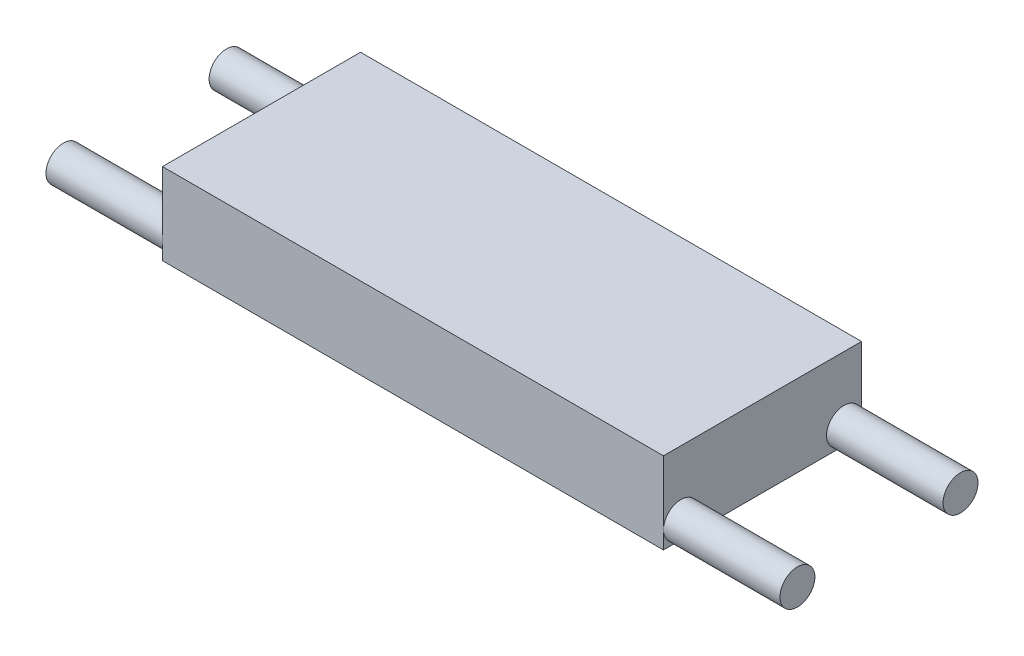
ISO-10303-21;
HEADER;
FILE_DESCRIPTION(('STEP AP214'),'2;1');
FILE_NAME('part.step','',(''),(''),'','','');
FILE_SCHEMA(('AUTOMOTIVE_DESIGN { 1 0 10303 214 1 1 1 1 }'));
ENDSEC;
DATA;
#1=APPLICATION_CONTEXT('core data for automotive mechanical design processes');
#2=APPLICATION_PROTOCOL_DEFINITION('international standard','automotive_design',2000,#1);
#3=PRODUCT_CONTEXT('',#1,'mechanical');
#4=PRODUCT('Part','Part','',(#3));
#5=PRODUCT_RELATED_PRODUCT_CATEGORY('part','',(#4));
#6=PRODUCT_DEFINITION_FORMATION('','',#4);
#7=PRODUCT_DEFINITION_CONTEXT('part definition',#1,'design');
#8=PRODUCT_DEFINITION('design','',#6,#7);
#9=PRODUCT_DEFINITION_SHAPE('','',#8);
#10=(LENGTH_UNIT() NAMED_UNIT(*) SI_UNIT(.MILLI.,.METRE.));
#11=(NAMED_UNIT(*) PLANE_ANGLE_UNIT() SI_UNIT($,.RADIAN.));
#12=(NAMED_UNIT(*) SI_UNIT($,.STERADIAN.) SOLID_ANGLE_UNIT());
#13=UNCERTAINTY_MEASURE_WITH_UNIT(LENGTH_MEASURE(1.E-05),#10,'distance_accuracy_value','');
#14=(GEOMETRIC_REPRESENTATION_CONTEXT(3) GLOBAL_UNCERTAINTY_ASSIGNED_CONTEXT((#13)) GLOBAL_UNIT_ASSIGNED_CONTEXT((#10,
#11,#12)) REPRESENTATION_CONTEXT('',''));
#15=CARTESIAN_POINT('',(0.,0.,0.));
#16=DIRECTION('',(0.,0.,1.));
#17=DIRECTION('',(1.,0.,0.));
#18=AXIS2_PLACEMENT_3D('',#15,#16,#17);
#19=CARTESIAN_POINT('',(0.,7.,0.));
#20=DIRECTION('',(1.,0.,0.));
#21=DIRECTION('',(0.,0.,-1.));
#22=AXIS2_PLACEMENT_3D('',#19,#20,#21);
#23=PLANE('',#22);
#24=DIRECTION('',(0.,-1.,0.));
#25=VECTOR('',#24,1.);
#26=CARTESIAN_POINT('',(0.,7.,0.));
#27=LINE('',#26,#25);
#28=CARTESIAN_POINT('',(0.,1.5,0.));
#29=VERTEX_POINT('',#28);
#30=CARTESIAN_POINT('',(0.,0.,0.));
#31=VERTEX_POINT('',#30);
#32=EDGE_CURVE('E109',#29,#31,#27,.T.);
#33=ORIENTED_EDGE('',*,*,#32,.F.);
#34=CARTESIAN_POINT('',(0.,1.5,-1.5));
#35=DIRECTION('',(1.,0.,0.));
#36=DIRECTION('',(0.,0.,-1.));
#37=AXIS2_PLACEMENT_3D('',#34,#35,#36);
#38=CIRCLE('',#37,1.5);
#39=CARTESIAN_POINT('',(0.,0.,-1.5));
#40=VERTEX_POINT('',#39);
#41=EDGE_CURVE('E51',#29,#40,#38,.T.);
#42=ORIENTED_EDGE('',*,*,#41,.T.);
#43=DIRECTION('',(0.,0.,1.));
#44=VECTOR('',#43,1.);
#45=CARTESIAN_POINT('',(0.,0.,0.));
#46=LINE('',#45,#44);
#47=EDGE_CURVE('E107',#40,#31,#46,.T.);
#48=ORIENTED_EDGE('',*,*,#47,.T.);
#49=EDGE_LOOP('',(#33,#42,#48));
#50=FACE_BOUND('',#49,.T.);
#51=ADVANCED_FACE('F34',(#50),#23,.F.);
#52=CARTESIAN_POINT('',(0.,0.,-15.5));
#53=VERTEX_POINT('',#52);
#54=EDGE_CURVE('E116',#53,#40,#46,.T.);
#55=ORIENTED_EDGE('',*,*,#54,.T.);
#56=EDGE_CURVE('E97',#40,#29,#38,.T.);
#57=ORIENTED_EDGE('',*,*,#56,.T.);
#58=CARTESIAN_POINT('',(0.,7.,0.));
#59=VERTEX_POINT('',#58);
#60=EDGE_CURVE('E38',#59,#29,#27,.T.);
#61=ORIENTED_EDGE('',*,*,#60,.F.);
#62=DIRECTION('',(0.,0.,1.));
#63=VECTOR('',#62,1.);
#64=CARTESIAN_POINT('',(0.,7.,0.));
#65=LINE('',#64,#63);
#66=CARTESIAN_POINT('',(0.,7.,-17.));
#67=VERTEX_POINT('',#66);
#68=EDGE_CURVE('E139',#67,#59,#65,.T.);
#69=ORIENTED_EDGE('',*,*,#68,.F.);
#70=DIRECTION('',(0.,-1.,0.));
#71=VECTOR('',#70,1.);
#72=CARTESIAN_POINT('',(0.,7.,-17.));
#73=LINE('',#72,#71);
#74=CARTESIAN_POINT('',(0.,1.5,-17.));
#75=VERTEX_POINT('',#74);
#76=EDGE_CURVE('E140',#67,#75,#73,.T.);
#77=ORIENTED_EDGE('',*,*,#76,.T.);
#78=CARTESIAN_POINT('',(0.,1.5,-15.5));
#79=DIRECTION('',(1.,0.,0.));
#80=DIRECTION('',(0.,0.,-1.));
#81=AXIS2_PLACEMENT_3D('',#78,#79,#80);
#82=CIRCLE('',#81,1.5);
#83=EDGE_CURVE('E45',#75,#53,#82,.T.);
#84=ORIENTED_EDGE('',*,*,#83,.T.);
#85=EDGE_LOOP('',(#55,#57,#61,#69,#77,#84));
#86=FACE_BOUND('',#85,.T.);
#87=ADVANCED_FACE('F124',(#86),#23,.F.);
#88=CARTESIAN_POINT('',(43.,7.,0.));
#89=DIRECTION('',(-1.,0.,0.));
#90=DIRECTION('',(0.,0.,1.));
#91=AXIS2_PLACEMENT_3D('',#88,#89,#90);
#92=PLANE('',#91);
#93=CARTESIAN_POINT('',(43.,1.5,-1.5));
#94=DIRECTION('',(1.,0.,0.));
#95=DIRECTION('',(0.,0.,-1.));
#96=AXIS2_PLACEMENT_3D('',#93,#94,#95);
#97=CIRCLE('',#96,1.5);
#98=CARTESIAN_POINT('',(43.,1.5,0.));
#99=VERTEX_POINT('',#98);
#100=CARTESIAN_POINT('',(43.,0.,-1.5));
#101=VERTEX_POINT('',#100);
#102=EDGE_CURVE('E155',#99,#101,#97,.T.);
#103=ORIENTED_EDGE('',*,*,#102,.F.);
#104=DIRECTION('',(0.,-1.,0.));
#105=VECTOR('',#104,1.);
#106=CARTESIAN_POINT('',(43.,7.,0.));
#107=LINE('',#106,#105);
#108=CARTESIAN_POINT('',(43.,0.,0.));
#109=VERTEX_POINT('',#108);
#110=EDGE_CURVE('E145',#99,#109,#107,.T.);
#111=ORIENTED_EDGE('',*,*,#110,.T.);
#112=DIRECTION('',(0.,0.,-1.));
#113=VECTOR('',#112,1.);
#114=CARTESIAN_POINT('',(43.,0.,0.));
#115=LINE('',#114,#113);
#116=EDGE_CURVE('E132',#109,#101,#115,.T.);
#117=ORIENTED_EDGE('',*,*,#116,.T.);
#118=EDGE_LOOP('',(#103,#111,#117));
#119=FACE_BOUND('',#118,.T.);
#120=ADVANCED_FACE('F153',(#119),#92,.F.);
#121=EDGE_CURVE('E247',#101,#99,#97,.T.);
#122=ORIENTED_EDGE('',*,*,#121,.F.);
#123=CARTESIAN_POINT('',(43.,0.,-15.5));
#124=VERTEX_POINT('',#123);
#125=EDGE_CURVE('E136',#101,#124,#115,.T.);
#126=ORIENTED_EDGE('',*,*,#125,.T.);
#127=CARTESIAN_POINT('',(43.,1.5,-15.5));
#128=DIRECTION('',(1.,0.,0.));
#129=DIRECTION('',(0.,0.,-1.));
#130=AXIS2_PLACEMENT_3D('',#127,#128,#129);
#131=CIRCLE('',#130,1.5);
#132=CARTESIAN_POINT('',(43.,1.5,-17.));
#133=VERTEX_POINT('',#132);
#134=EDGE_CURVE('E178',#133,#124,#131,.T.);
#135=ORIENTED_EDGE('',*,*,#134,.F.);
#136=DIRECTION('',(0.,-1.,0.));
#137=VECTOR('',#136,1.);
#138=CARTESIAN_POINT('',(43.,7.,-17.));
#139=LINE('',#138,#137);
#140=CARTESIAN_POINT('',(43.,7.,-17.));
#141=VERTEX_POINT('',#140);
#142=EDGE_CURVE('E144',#141,#133,#139,.T.);
#143=ORIENTED_EDGE('',*,*,#142,.F.);
#144=DIRECTION('',(0.,0.,-1.));
#145=VECTOR('',#144,1.);
#146=CARTESIAN_POINT('',(43.,7.,0.));
#147=LINE('',#146,#145);
#148=CARTESIAN_POINT('',(43.,7.,0.));
#149=VERTEX_POINT('',#148);
#150=EDGE_CURVE('E177',#149,#141,#147,.T.);
#151=ORIENTED_EDGE('',*,*,#150,.F.);
#152=EDGE_CURVE('E146',#149,#99,#107,.T.);
#153=ORIENTED_EDGE('',*,*,#152,.T.);
#154=EDGE_LOOP('',(#122,#126,#135,#143,#151,#153));
#155=FACE_BOUND('',#154,.T.);
#156=ADVANCED_FACE('F176',(#155),#92,.F.);
#157=CARTESIAN_POINT('',(0.,0.,-17.));
#158=VERTEX_POINT('',#157);
#159=EDGE_CURVE('E123',#158,#53,#46,.T.);
#160=ORIENTED_EDGE('',*,*,#159,.T.);
#161=EDGE_CURVE('E11',#53,#75,#82,.T.);
#162=ORIENTED_EDGE('',*,*,#161,.T.);
#163=EDGE_CURVE('E143',#75,#158,#73,.T.);
#164=ORIENTED_EDGE('',*,*,#163,.T.);
#165=EDGE_LOOP('',(#160,#162,#164));
#166=FACE_BOUND('',#165,.T.);
#167=ADVANCED_FACE('F36',(#166),#23,.F.);
#168=CARTESIAN_POINT('',(0.,7.,0.));
#169=DIRECTION('',(0.,0.,-1.));
#170=DIRECTION('',(-1.,0.,0.));
#171=AXIS2_PLACEMENT_3D('',#168,#169,#170);
#172=PLANE('',#171);
#173=DIRECTION('',(1.,0.,0.));
#174=VECTOR('',#173,1.);
#175=CARTESIAN_POINT('',(0.,0.,0.));
#176=LINE('',#175,#174);
#177=EDGE_CURVE('E120',#31,#109,#176,.T.);
#178=ORIENTED_EDGE('',*,*,#177,.T.);
#179=ORIENTED_EDGE('',*,*,#110,.F.);
#180=ORIENTED_EDGE('',*,*,#152,.F.);
#181=DIRECTION('',(1.,0.,0.));
#182=VECTOR('',#181,1.);
#183=CARTESIAN_POINT('',(0.,7.,0.));
#184=LINE('',#183,#182);
#185=EDGE_CURVE('E188',#59,#149,#184,.T.);
#186=ORIENTED_EDGE('',*,*,#185,.F.);
#187=ORIENTED_EDGE('',*,*,#60,.T.);
#188=ORIENTED_EDGE('',*,*,#32,.T.);
#189=EDGE_LOOP('',(#178,#179,#180,#186,#187,#188));
#190=FACE_BOUND('',#189,.T.);
#191=ADVANCED_FACE('F158',(#190),#172,.F.);
#192=EDGE_CURVE('E43',#124,#133,#131,.T.);
#193=ORIENTED_EDGE('',*,*,#192,.F.);
#194=CARTESIAN_POINT('',(43.,0.,-17.));
#195=VERTEX_POINT('',#194);
#196=EDGE_CURVE('E131',#124,#195,#115,.T.);
#197=ORIENTED_EDGE('',*,*,#196,.T.);
#198=EDGE_CURVE('E142',#133,#195,#139,.T.);
#199=ORIENTED_EDGE('',*,*,#198,.F.);
#200=EDGE_LOOP('',(#193,#197,#199));
#201=FACE_BOUND('',#200,.T.);
#202=ADVANCED_FACE('F168',(#201),#92,.F.);
#203=CARTESIAN_POINT('',(0.,7.,-17.));
#204=DIRECTION('',(0.,0.,1.));
#205=DIRECTION('',(1.,0.,0.));
#206=AXIS2_PLACEMENT_3D('',#203,#204,#205);
#207=PLANE('',#206);
#208=DIRECTION('',(-1.,0.,0.));
#209=VECTOR('',#208,1.);
#210=CARTESIAN_POINT('',(0.,0.,-17.));
#211=LINE('',#210,#209);
#212=EDGE_CURVE('E135',#195,#158,#211,.T.);
#213=ORIENTED_EDGE('',*,*,#212,.T.);
#214=ORIENTED_EDGE('',*,*,#163,.F.);
#215=ORIENTED_EDGE('',*,*,#76,.F.);
#216=DIRECTION('',(-1.,0.,0.));
#217=VECTOR('',#216,1.);
#218=CARTESIAN_POINT('',(0.,7.,-17.));
#219=LINE('',#218,#217);
#220=EDGE_CURVE('E128',#141,#67,#219,.T.);
#221=ORIENTED_EDGE('',*,*,#220,.F.);
#222=ORIENTED_EDGE('',*,*,#142,.T.);
#223=ORIENTED_EDGE('',*,*,#198,.T.);
#224=EDGE_LOOP('',(#213,#214,#215,#221,#222,#223));
#225=FACE_BOUND('',#224,.T.);
#226=ADVANCED_FACE('F172',(#225),#207,.F.);
#227=CARTESIAN_POINT('',(0.,7.,0.));
#228=DIRECTION('',(0.,-1.,0.));
#229=DIRECTION('',(0.,0.,-1.));
#230=AXIS2_PLACEMENT_3D('',#227,#228,#229);
#231=PLANE('',#230);
#232=ORIENTED_EDGE('',*,*,#68,.T.);
#233=ORIENTED_EDGE('',*,*,#185,.T.);
#234=ORIENTED_EDGE('',*,*,#150,.T.);
#235=ORIENTED_EDGE('',*,*,#220,.T.);
#236=EDGE_LOOP('',(#232,#233,#234,#235));
#237=FACE_BOUND('',#236,.T.);
#238=ADVANCED_FACE('F225',(#237),#231,.F.);
#239=CARTESIAN_POINT('',(0.,0.,0.));
#240=DIRECTION('',(0.,-1.,0.));
#241=DIRECTION('',(0.,0.,-1.));
#242=AXIS2_PLACEMENT_3D('',#239,#240,#241);
#243=PLANE('',#242);
#244=ORIENTED_EDGE('',*,*,#159,.F.);
#245=ORIENTED_EDGE('',*,*,#212,.F.);
#246=ORIENTED_EDGE('',*,*,#196,.F.);
#247=ORIENTED_EDGE('',*,*,#125,.F.);
#248=ORIENTED_EDGE('',*,*,#116,.F.);
#249=ORIENTED_EDGE('',*,*,#177,.F.);
#250=ORIENTED_EDGE('',*,*,#47,.F.);
#251=ORIENTED_EDGE('',*,*,#54,.F.);
#252=EDGE_LOOP('',(#244,#245,#246,#247,#248,#249,#250,#251));
#253=FACE_BOUND('',#252,.T.);
#254=ADVANCED_FACE('F115',(#253),#243,.T.);
#255=CARTESIAN_POINT('',(53.,1.5,-15.5));
#256=DIRECTION('',(-1.,0.,0.));
#257=DIRECTION('',(0.,0.,1.));
#258=AXIS2_PLACEMENT_3D('',#255,#256,#257);
#259=CYLINDRICAL_SURFACE('',#258,1.5);
#260=CARTESIAN_POINT('',(53.,1.5,-15.5));
#261=DIRECTION('',(1.,0.,0.));
#262=DIRECTION('',(0.,0.,-1.));
#263=AXIS2_PLACEMENT_3D('',#260,#261,#262);
#264=CIRCLE('',#263,1.5);
#265=CARTESIAN_POINT('',(53.,1.5,-17.));
#266=VERTEX_POINT('',#265);
#267=EDGE_CURVE('E121',#266,#266,#264,.T.);
#268=ORIENTED_EDGE('',*,*,#267,.F.);
#269=EDGE_LOOP('',(#268));
#270=FACE_BOUND('',#269,.T.);
#271=ORIENTED_EDGE('',*,*,#134,.T.);
#272=ORIENTED_EDGE('',*,*,#192,.T.);
#273=EDGE_LOOP('',(#271,#272));
#274=FACE_BOUND('',#273,.T.);
#275=ADVANCED_FACE('F182',(#270,#274),#259,.T.);
#276=CARTESIAN_POINT('',(53.,1.5,-15.5));
#277=DIRECTION('',(1.,0.,0.));
#278=DIRECTION('',(0.,0.,-1.));
#279=AXIS2_PLACEMENT_3D('',#276,#277,#278);
#280=PLANE('',#279);
#281=ORIENTED_EDGE('',*,*,#267,.T.);
#282=EDGE_LOOP('',(#281));
#283=FACE_BOUND('',#282,.T.);
#284=ADVANCED_FACE('F235',(#283),#280,.T.);
#285=CARTESIAN_POINT('',(53.,1.5,-1.5));
#286=DIRECTION('',(-1.,0.,0.));
#287=DIRECTION('',(0.,0.,1.));
#288=AXIS2_PLACEMENT_3D('',#285,#286,#287);
#289=CYLINDRICAL_SURFACE('',#288,1.5);
#290=CARTESIAN_POINT('',(53.,1.5,-1.5));
#291=DIRECTION('',(1.,0.,0.));
#292=DIRECTION('',(0.,0.,-1.));
#293=AXIS2_PLACEMENT_3D('',#290,#291,#292);
#294=CIRCLE('',#293,1.5);
#295=CARTESIAN_POINT('',(53.,1.5,-3.));
#296=VERTEX_POINT('',#295);
#297=EDGE_CURVE('E180',#296,#296,#294,.T.);
#298=ORIENTED_EDGE('',*,*,#297,.F.);
#299=EDGE_LOOP('',(#298));
#300=FACE_BOUND('',#299,.T.);
#301=ORIENTED_EDGE('',*,*,#102,.T.);
#302=ORIENTED_EDGE('',*,*,#121,.T.);
#303=EDGE_LOOP('',(#301,#302));
#304=FACE_BOUND('',#303,.T.);
#305=ADVANCED_FACE('F203',(#300,#304),#289,.T.);
#306=CARTESIAN_POINT('',(53.,1.5,-1.5));
#307=DIRECTION('',(1.,0.,0.));
#308=DIRECTION('',(0.,0.,-1.));
#309=AXIS2_PLACEMENT_3D('',#306,#307,#308);
#310=PLANE('',#309);
#311=ORIENTED_EDGE('',*,*,#297,.T.);
#312=EDGE_LOOP('',(#311));
#313=FACE_BOUND('',#312,.T.);
#314=ADVANCED_FACE('F194',(#313),#310,.T.);
#315=CARTESIAN_POINT('',(-10.,1.5,-15.5));
#316=DIRECTION('',(1.,0.,0.));
#317=DIRECTION('',(0.,0.,-1.));
#318=AXIS2_PLACEMENT_3D('',#315,#316,#317);
#319=CYLINDRICAL_SURFACE('',#318,1.5);
#320=CARTESIAN_POINT('',(-10.,1.5,-15.5));
#321=DIRECTION('',(1.,0.,0.));
#322=DIRECTION('',(0.,0.,-1.));
#323=AXIS2_PLACEMENT_3D('',#320,#321,#322);
#324=CIRCLE('',#323,1.5);
#325=CARTESIAN_POINT('',(-10.,1.5,-17.));
#326=VERTEX_POINT('',#325);
#327=EDGE_CURVE('E249',#326,#326,#324,.T.);
#328=ORIENTED_EDGE('',*,*,#327,.T.);
#329=EDGE_LOOP('',(#328));
#330=FACE_BOUND('',#329,.T.);
#331=ORIENTED_EDGE('',*,*,#83,.F.);
#332=ORIENTED_EDGE('',*,*,#161,.F.);
#333=EDGE_LOOP('',(#331,#332));
#334=FACE_BOUND('',#333,.T.);
#335=ADVANCED_FACE('F191',(#330,#334),#319,.T.);
#336=CARTESIAN_POINT('',(-10.,1.5,-15.5));
#337=DIRECTION('',(-1.,0.,0.));
#338=DIRECTION('',(0.,0.,-1.));
#339=AXIS2_PLACEMENT_3D('',#336,#337,#338);
#340=PLANE('',#339);
#341=ORIENTED_EDGE('',*,*,#327,.F.);
#342=EDGE_LOOP('',(#341));
#343=FACE_BOUND('',#342,.T.);
#344=ADVANCED_FACE('F193',(#343),#340,.T.);
#345=CARTESIAN_POINT('',(-10.,1.5,-1.5));
#346=DIRECTION('',(1.,0.,0.));
#347=DIRECTION('',(0.,0.,-1.));
#348=AXIS2_PLACEMENT_3D('',#345,#346,#347);
#349=CYLINDRICAL_SURFACE('',#348,1.5);
#350=CARTESIAN_POINT('',(-10.,1.5,-1.5));
#351=DIRECTION('',(1.,0.,0.));
#352=DIRECTION('',(0.,0.,-1.));
#353=AXIS2_PLACEMENT_3D('',#350,#351,#352);
#354=CIRCLE('',#353,1.5);
#355=CARTESIAN_POINT('',(-10.,1.5,-3.));
#356=VERTEX_POINT('',#355);
#357=EDGE_CURVE('E111',#356,#356,#354,.T.);
#358=ORIENTED_EDGE('',*,*,#357,.T.);
#359=EDGE_LOOP('',(#358));
#360=FACE_BOUND('',#359,.T.);
#361=ORIENTED_EDGE('',*,*,#41,.F.);
#362=ORIENTED_EDGE('',*,*,#56,.F.);
#363=EDGE_LOOP('',(#361,#362));
#364=FACE_BOUND('',#363,.T.);
#365=ADVANCED_FACE('F98',(#360,#364),#349,.T.);
#366=CARTESIAN_POINT('',(-10.,1.5,-1.5));
#367=DIRECTION('',(-1.,0.,0.));
#368=DIRECTION('',(0.,0.,-1.));
#369=AXIS2_PLACEMENT_3D('',#366,#367,#368);
#370=PLANE('',#369);
#371=ORIENTED_EDGE('',*,*,#357,.F.);
#372=EDGE_LOOP('',(#371));
#373=FACE_BOUND('',#372,.T.);
#374=ADVANCED_FACE('F256',(#373),#370,.T.);
#375=CLOSED_SHELL('',(#51,#87,#120,#156,#167,#191,#202,#226,#238,#254,#275,#284,#305,#314,#335,
#344,#365,#374));
#376=MANIFOLD_SOLID_BREP('B2',#375);
#377=ADVANCED_BREP_SHAPE_REPRESENTATION('',(#18,#376),#14);
#378=SHAPE_DEFINITION_REPRESENTATION(#9,#377);
ENDSEC;
END-ISO-10303-21;
